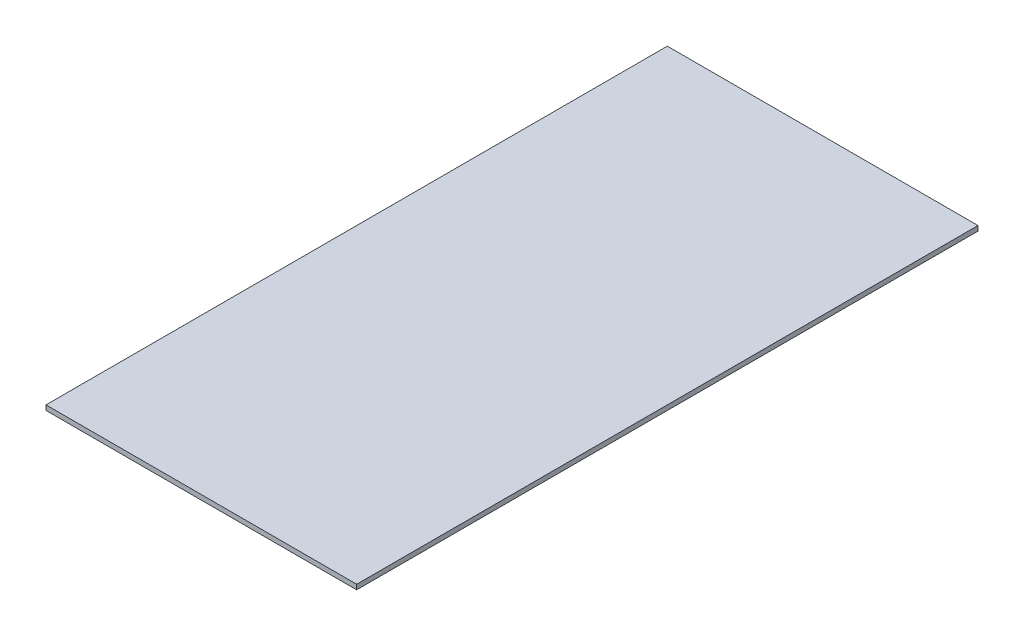
ISO-10303-21;
HEADER;
FILE_DESCRIPTION(('STEP AP214'),'2;1');
FILE_NAME('part.step','',(''),(''),'','','');
FILE_SCHEMA(('AUTOMOTIVE_DESIGN { 1 0 10303 214 1 1 1 1 }'));
ENDSEC;
DATA;
#1=APPLICATION_CONTEXT('core data for automotive mechanical design processes');
#2=APPLICATION_PROTOCOL_DEFINITION('international standard','automotive_design',2000,#1);
#3=PRODUCT_CONTEXT('',#1,'mechanical');
#4=PRODUCT('Part','Part','',(#3));
#5=PRODUCT_RELATED_PRODUCT_CATEGORY('part','',(#4));
#6=PRODUCT_DEFINITION_FORMATION('','',#4);
#7=PRODUCT_DEFINITION_CONTEXT('part definition',#1,'design');
#8=PRODUCT_DEFINITION('design','',#6,#7);
#9=PRODUCT_DEFINITION_SHAPE('','',#8);
#10=(LENGTH_UNIT() NAMED_UNIT(*) SI_UNIT(.MILLI.,.METRE.));
#11=(NAMED_UNIT(*) PLANE_ANGLE_UNIT() SI_UNIT($,.RADIAN.));
#12=(NAMED_UNIT(*) SI_UNIT($,.STERADIAN.) SOLID_ANGLE_UNIT());
#13=UNCERTAINTY_MEASURE_WITH_UNIT(LENGTH_MEASURE(1.E-05),#10,'distance_accuracy_value','');
#14=(GEOMETRIC_REPRESENTATION_CONTEXT(3) GLOBAL_UNCERTAINTY_ASSIGNED_CONTEXT((#13)) GLOBAL_UNIT_ASSIGNED_CONTEXT((#10,
#11,#12)) REPRESENTATION_CONTEXT('',''));
#15=CARTESIAN_POINT('',(0.,0.,0.));
#16=DIRECTION('',(0.,0.,1.));
#17=DIRECTION('',(1.,0.,0.));
#18=AXIS2_PLACEMENT_3D('',#15,#16,#17);
#19=CARTESIAN_POINT('',(0.,3.175,0.));
#20=DIRECTION('',(-1.,0.,0.));
#21=DIRECTION('',(0.,0.,1.));
#22=AXIS2_PLACEMENT_3D('',#19,#20,#21);
#23=PLANE('',#22);
#24=DIRECTION('',(0.,0.,-1.));
#25=VECTOR('',#24,1.);
#26=CARTESIAN_POINT('',(0.,0.,0.));
#27=LINE('',#26,#25);
#28=CARTESIAN_POINT('',(0.,0.,406.4));
#29=VERTEX_POINT('',#28);
#30=CARTESIAN_POINT('',(0.,0.,0.));
#31=VERTEX_POINT('',#30);
#32=EDGE_CURVE('E100',#29,#31,#27,.T.);
#33=ORIENTED_EDGE('',*,*,#32,.T.);
#34=DIRECTION('',(0.,-1.,0.));
#35=VECTOR('',#34,1.);
#36=CARTESIAN_POINT('',(0.,3.175,0.));
#37=LINE('',#36,#35);
#38=CARTESIAN_POINT('',(0.,3.175,0.));
#39=VERTEX_POINT('',#38);
#40=EDGE_CURVE('E11',#39,#31,#37,.T.);
#41=ORIENTED_EDGE('',*,*,#40,.F.);
#42=DIRECTION('',(0.,0.,-1.));
#43=VECTOR('',#42,1.);
#44=CARTESIAN_POINT('',(0.,3.175,0.));
#45=LINE('',#44,#43);
#46=CARTESIAN_POINT('',(0.,3.175,406.4));
#47=VERTEX_POINT('',#46);
#48=EDGE_CURVE('E88',#47,#39,#45,.T.);
#49=ORIENTED_EDGE('',*,*,#48,.F.);
#50=DIRECTION('',(0.,-1.,0.));
#51=VECTOR('',#50,1.);
#52=CARTESIAN_POINT('',(0.,3.175,406.4));
#53=LINE('',#52,#51);
#54=EDGE_CURVE('E96',#47,#29,#53,.T.);
#55=ORIENTED_EDGE('',*,*,#54,.T.);
#56=EDGE_LOOP('',(#33,#41,#49,#55));
#57=FACE_BOUND('',#56,.T.);
#58=ADVANCED_FACE('F37',(#57),#23,.F.);
#59=CARTESIAN_POINT('',(0.,3.175,0.));
#60=DIRECTION('',(0.,0.,1.));
#61=DIRECTION('',(1.,0.,0.));
#62=AXIS2_PLACEMENT_3D('',#59,#60,#61);
#63=PLANE('',#62);
#64=DIRECTION('',(-1.,0.,0.));
#65=VECTOR('',#64,1.);
#66=CARTESIAN_POINT('',(0.,0.,0.));
#67=LINE('',#66,#65);
#68=CARTESIAN_POINT('',(-203.2,0.,0.));
#69=VERTEX_POINT('',#68);
#70=EDGE_CURVE('E92',#31,#69,#67,.T.);
#71=ORIENTED_EDGE('',*,*,#70,.T.);
#72=DIRECTION('',(0.,-1.,0.));
#73=VECTOR('',#72,1.);
#74=CARTESIAN_POINT('',(-203.2,3.175,0.));
#75=LINE('',#74,#73);
#76=CARTESIAN_POINT('',(-203.2,3.175,0.));
#77=VERTEX_POINT('',#76);
#78=EDGE_CURVE('E45',#77,#69,#75,.T.);
#79=ORIENTED_EDGE('',*,*,#78,.F.);
#80=DIRECTION('',(-1.,0.,0.));
#81=VECTOR('',#80,1.);
#82=CARTESIAN_POINT('',(0.,3.175,0.));
#83=LINE('',#82,#81);
#84=EDGE_CURVE('E83',#39,#77,#83,.T.);
#85=ORIENTED_EDGE('',*,*,#84,.F.);
#86=ORIENTED_EDGE('',*,*,#40,.T.);
#87=EDGE_LOOP('',(#71,#79,#85,#86));
#88=FACE_BOUND('',#87,.T.);
#89=ADVANCED_FACE('F91',(#88),#63,.F.);
#90=CARTESIAN_POINT('',(-203.2,3.175,0.));
#91=DIRECTION('',(1.,0.,0.));
#92=DIRECTION('',(0.,0.,-1.));
#93=AXIS2_PLACEMENT_3D('',#90,#91,#92);
#94=PLANE('',#93);
#95=DIRECTION('',(0.,0.,1.));
#96=VECTOR('',#95,1.);
#97=CARTESIAN_POINT('',(-203.2,0.,0.));
#98=LINE('',#97,#96);
#99=CARTESIAN_POINT('',(-203.2,0.,406.4));
#100=VERTEX_POINT('',#99);
#101=EDGE_CURVE('E70',#69,#100,#98,.T.);
#102=ORIENTED_EDGE('',*,*,#101,.T.);
#103=DIRECTION('',(0.,-1.,0.));
#104=VECTOR('',#103,1.);
#105=CARTESIAN_POINT('',(-203.2,3.175,406.4));
#106=LINE('',#105,#104);
#107=CARTESIAN_POINT('',(-203.2,3.175,406.4));
#108=VERTEX_POINT('',#107);
#109=EDGE_CURVE('E93',#108,#100,#106,.T.);
#110=ORIENTED_EDGE('',*,*,#109,.F.);
#111=DIRECTION('',(0.,0.,1.));
#112=VECTOR('',#111,1.);
#113=CARTESIAN_POINT('',(-203.2,3.175,0.));
#114=LINE('',#113,#112);
#115=EDGE_CURVE('E86',#77,#108,#114,.T.);
#116=ORIENTED_EDGE('',*,*,#115,.F.);
#117=ORIENTED_EDGE('',*,*,#78,.T.);
#118=EDGE_LOOP('',(#102,#110,#116,#117));
#119=FACE_BOUND('',#118,.T.);
#120=ADVANCED_FACE('F94',(#119),#94,.F.);
#121=CARTESIAN_POINT('',(0.,3.175,406.4));
#122=DIRECTION('',(0.,0.,-1.));
#123=DIRECTION('',(-1.,0.,0.));
#124=AXIS2_PLACEMENT_3D('',#121,#122,#123);
#125=PLANE('',#124);
#126=DIRECTION('',(1.,0.,0.));
#127=VECTOR('',#126,1.);
#128=CARTESIAN_POINT('',(0.,0.,406.4));
#129=LINE('',#128,#127);
#130=EDGE_CURVE('E76',#100,#29,#129,.T.);
#131=ORIENTED_EDGE('',*,*,#130,.T.);
#132=ORIENTED_EDGE('',*,*,#54,.F.);
#133=DIRECTION('',(1.,0.,0.));
#134=VECTOR('',#133,1.);
#135=CARTESIAN_POINT('',(0.,3.175,406.4));
#136=LINE('',#135,#134);
#137=EDGE_CURVE('E53',#108,#47,#136,.T.);
#138=ORIENTED_EDGE('',*,*,#137,.F.);
#139=ORIENTED_EDGE('',*,*,#109,.T.);
#140=EDGE_LOOP('',(#131,#132,#138,#139));
#141=FACE_BOUND('',#140,.T.);
#142=ADVANCED_FACE('F107',(#141),#125,.F.);
#143=CARTESIAN_POINT('',(0.,3.175,0.));
#144=DIRECTION('',(0.,-1.,0.));
#145=DIRECTION('',(0.,0.,-1.));
#146=AXIS2_PLACEMENT_3D('',#143,#144,#145);
#147=PLANE('',#146);
#148=ORIENTED_EDGE('',*,*,#48,.T.);
#149=ORIENTED_EDGE('',*,*,#84,.T.);
#150=ORIENTED_EDGE('',*,*,#115,.T.);
#151=ORIENTED_EDGE('',*,*,#137,.T.);
#152=EDGE_LOOP('',(#148,#149,#150,#151));
#153=FACE_BOUND('',#152,.T.);
#154=ADVANCED_FACE('F84',(#153),#147,.F.);
#155=CARTESIAN_POINT('',(0.,0.,0.));
#156=DIRECTION('',(0.,-1.,0.));
#157=DIRECTION('',(0.,0.,-1.));
#158=AXIS2_PLACEMENT_3D('',#155,#156,#157);
#159=PLANE('',#158);
#160=ORIENTED_EDGE('',*,*,#32,.F.);
#161=ORIENTED_EDGE('',*,*,#130,.F.);
#162=ORIENTED_EDGE('',*,*,#101,.F.);
#163=ORIENTED_EDGE('',*,*,#70,.F.);
#164=EDGE_LOOP('',(#160,#161,#162,#163));
#165=FACE_BOUND('',#164,.T.);
#166=ADVANCED_FACE('F110',(#165),#159,.T.);
#167=CLOSED_SHELL('',(#58,#89,#120,#142,#154,#166));
#168=MANIFOLD_SOLID_BREP('B2',#167);
#169=ADVANCED_BREP_SHAPE_REPRESENTATION('',(#18,#168),#14);
#170=SHAPE_DEFINITION_REPRESENTATION(#9,#169);
ENDSEC;
END-ISO-10303-21;
